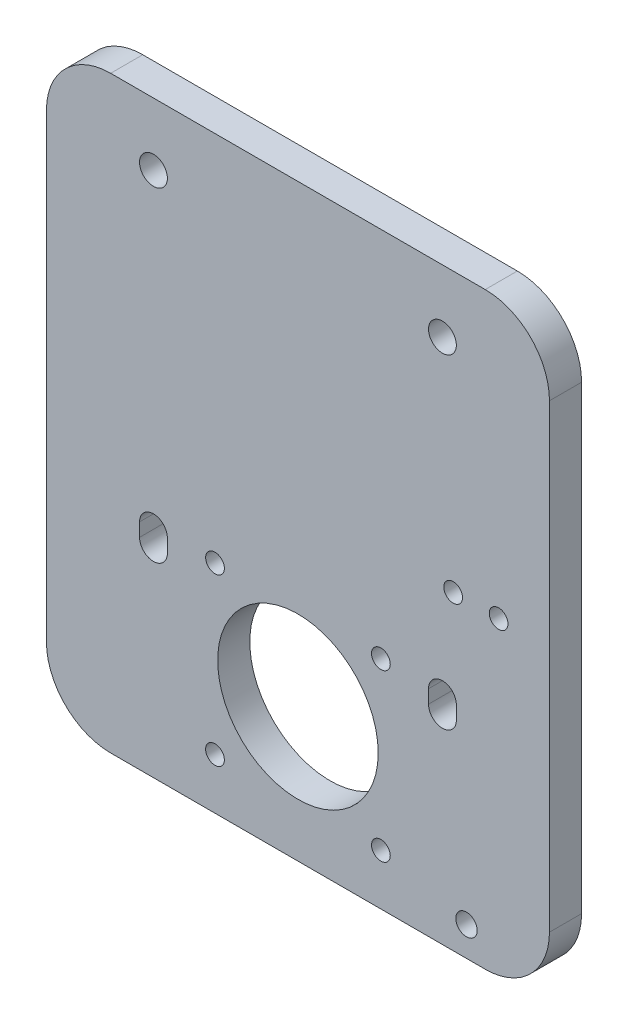
ISO-10303-21;
HEADER;
FILE_DESCRIPTION(('STEP AP214'),'2;1');
FILE_NAME('part.step','',(''),(''),'','','');
FILE_SCHEMA(('AUTOMOTIVE_DESIGN { 1 0 10303 214 1 1 1 1 }'));
ENDSEC;
DATA;
#1=APPLICATION_CONTEXT('core data for automotive mechanical design processes');
#2=APPLICATION_PROTOCOL_DEFINITION('international standard','automotive_design',2000,#1);
#3=PRODUCT_CONTEXT('',#1,'mechanical');
#4=PRODUCT('Part','Part','',(#3));
#5=PRODUCT_RELATED_PRODUCT_CATEGORY('part','',(#4));
#6=PRODUCT_DEFINITION_FORMATION('','',#4);
#7=PRODUCT_DEFINITION_CONTEXT('part definition',#1,'design');
#8=PRODUCT_DEFINITION('design','',#6,#7);
#9=PRODUCT_DEFINITION_SHAPE('','',#8);
#10=(LENGTH_UNIT() NAMED_UNIT(*) SI_UNIT(.MILLI.,.METRE.));
#11=(NAMED_UNIT(*) PLANE_ANGLE_UNIT() SI_UNIT($,.RADIAN.));
#12=(NAMED_UNIT(*) SI_UNIT($,.STERADIAN.) SOLID_ANGLE_UNIT());
#13=UNCERTAINTY_MEASURE_WITH_UNIT(LENGTH_MEASURE(1.E-05),#10,'distance_accuracy_value','');
#14=(GEOMETRIC_REPRESENTATION_CONTEXT(3) GLOBAL_UNCERTAINTY_ASSIGNED_CONTEXT((#13)) GLOBAL_UNIT_ASSIGNED_CONTEXT((#10,
#11,#12)) REPRESENTATION_CONTEXT('',''));
#15=CARTESIAN_POINT('',(0.,0.,0.));
#16=DIRECTION('',(0.,0.,1.));
#17=DIRECTION('',(1.,0.,0.));
#18=AXIS2_PLACEMENT_3D('',#15,#16,#17);
#19=CARTESIAN_POINT('',(27.,37.6,6.));
#20=DIRECTION('',(0.,0.,-1.));
#21=DIRECTION('',(-1.,0.,0.));
#22=AXIS2_PLACEMENT_3D('',#19,#20,#21);
#23=CYLINDRICAL_SURFACE('',#22,2.60000000000222);
#24=CARTESIAN_POINT('',(27.,37.6,0.));
#25=DIRECTION('',(0.,0.,1.));
#26=DIRECTION('',(1.,0.,0.));
#27=AXIS2_PLACEMENT_3D('',#24,#25,#26);
#28=CIRCLE('',#27,2.60000000000222);
#29=CARTESIAN_POINT('',(24.3999999999978,37.6,0.));
#30=VERTEX_POINT('',#29);
#31=CARTESIAN_POINT('',(29.6000000000022,37.6,0.));
#32=VERTEX_POINT('',#31);
#33=EDGE_CURVE('E231',#30,#32,#28,.T.);
#34=ORIENTED_EDGE('',*,*,#33,.F.);
#35=DIRECTION('',(0.,0.,-1.));
#36=VECTOR('',#35,1.);
#37=CARTESIAN_POINT('',(24.3999999999978,37.6,6.));
#38=LINE('',#37,#36);
#39=CARTESIAN_POINT('',(24.3999999999978,37.6,6.));
#40=VERTEX_POINT('',#39);
#41=EDGE_CURVE('E11',#40,#30,#38,.T.);
#42=ORIENTED_EDGE('',*,*,#41,.F.);
#43=CARTESIAN_POINT('',(27.,37.6,6.));
#44=DIRECTION('',(0.,0.,1.));
#45=DIRECTION('',(1.,0.,0.));
#46=AXIS2_PLACEMENT_3D('',#43,#44,#45);
#47=CIRCLE('',#46,2.60000000000222);
#48=CARTESIAN_POINT('',(29.6000000000022,37.6,6.));
#49=VERTEX_POINT('',#48);
#50=EDGE_CURVE('E177',#40,#49,#47,.T.);
#51=ORIENTED_EDGE('',*,*,#50,.T.);
#52=DIRECTION('',(0.,0.,-1.));
#53=VECTOR('',#52,1.);
#54=CARTESIAN_POINT('',(29.6000000000022,37.6,6.));
#55=LINE('',#54,#53);
#56=EDGE_CURVE('E57',#49,#32,#55,.T.);
#57=ORIENTED_EDGE('',*,*,#56,.T.);
#58=EDGE_LOOP('',(#34,#42,#51,#57));
#59=FACE_BOUND('',#58,.T.);
#60=ADVANCED_FACE('F38',(#59),#23,.F.);
#61=CARTESIAN_POINT('',(24.3999999999978,0.,6.));
#62=DIRECTION('',(1.,0.,0.));
#63=DIRECTION('',(0.,0.,-1.));
#64=AXIS2_PLACEMENT_3D('',#61,#62,#63);
#65=PLANE('',#64);
#66=DIRECTION('',(0.,-1.,0.));
#67=VECTOR('',#66,1.);
#68=CARTESIAN_POINT('',(24.3999999999978,0.,0.));
#69=LINE('',#68,#67);
#70=CARTESIAN_POINT('',(24.3999999999978,40.1000000000124,0.));
#71=VERTEX_POINT('',#70);
#72=EDGE_CURVE('E164',#71,#30,#69,.T.);
#73=ORIENTED_EDGE('',*,*,#72,.F.);
#74=DIRECTION('',(0.,0.,-1.));
#75=VECTOR('',#74,1.);
#76=CARTESIAN_POINT('',(24.3999999999978,40.1000000000124,6.));
#77=LINE('',#76,#75);
#78=CARTESIAN_POINT('',(24.3999999999978,40.1000000000124,6.));
#79=VERTEX_POINT('',#78);
#80=EDGE_CURVE('E48',#79,#71,#77,.T.);
#81=ORIENTED_EDGE('',*,*,#80,.F.);
#82=DIRECTION('',(0.,-1.,0.));
#83=VECTOR('',#82,1.);
#84=CARTESIAN_POINT('',(24.3999999999978,0.,6.));
#85=LINE('',#84,#83);
#86=EDGE_CURVE('E162',#79,#40,#85,.T.);
#87=ORIENTED_EDGE('',*,*,#86,.T.);
#88=ORIENTED_EDGE('',*,*,#41,.T.);
#89=EDGE_LOOP('',(#73,#81,#87,#88));
#90=FACE_BOUND('',#89,.T.);
#91=ADVANCED_FACE('F160',(#90),#65,.T.);
#92=CARTESIAN_POINT('',(27.,40.1000000000124,6.));
#93=DIRECTION('',(0.,0.,-1.));
#94=DIRECTION('',(-1.,0.,0.));
#95=AXIS2_PLACEMENT_3D('',#92,#93,#94);
#96=CYLINDRICAL_SURFACE('',#95,2.60000000000222);
#97=CARTESIAN_POINT('',(27.,40.1000000000124,0.));
#98=DIRECTION('',(0.,0.,1.));
#99=DIRECTION('',(1.,0.,0.));
#100=AXIS2_PLACEMENT_3D('',#97,#98,#99);
#101=CIRCLE('',#100,2.60000000000222);
#102=CARTESIAN_POINT('',(29.6000000000022,40.1000000000124,0.));
#103=VERTEX_POINT('',#102);
#104=EDGE_CURVE('E234',#71,#103,#101,.F.);
#105=ORIENTED_EDGE('',*,*,#104,.T.);
#106=DIRECTION('',(0.,0.,-1.));
#107=VECTOR('',#106,1.);
#108=CARTESIAN_POINT('',(29.6000000000022,40.1000000000124,6.));
#109=LINE('',#108,#107);
#110=CARTESIAN_POINT('',(29.6000000000022,40.1000000000124,6.));
#111=VERTEX_POINT('',#110);
#112=EDGE_CURVE('E107',#111,#103,#109,.T.);
#113=ORIENTED_EDGE('',*,*,#112,.F.);
#114=CARTESIAN_POINT('',(27.,40.1000000000124,6.));
#115=DIRECTION('',(0.,0.,1.));
#116=DIRECTION('',(1.,0.,0.));
#117=AXIS2_PLACEMENT_3D('',#114,#115,#116);
#118=CIRCLE('',#117,2.60000000000222);
#119=EDGE_CURVE('E168',#79,#111,#118,.F.);
#120=ORIENTED_EDGE('',*,*,#119,.F.);
#121=ORIENTED_EDGE('',*,*,#80,.T.);
#122=EDGE_LOOP('',(#105,#113,#120,#121));
#123=FACE_BOUND('',#122,.T.);
#124=ADVANCED_FACE('F169',(#123),#96,.F.);
#125=CARTESIAN_POINT('',(-35.,98.,6.));
#126=DIRECTION('',(0.,0.,-1.));
#127=DIRECTION('',(-1.,0.,0.));
#128=AXIS2_PLACEMENT_3D('',#125,#126,#127);
#129=CYLINDRICAL_SURFACE('',#128,12.);
#130=CARTESIAN_POINT('',(-35.,98.,0.));
#131=DIRECTION('',(0.,0.,1.));
#132=DIRECTION('',(1.,0.,0.));
#133=AXIS2_PLACEMENT_3D('',#130,#131,#132);
#134=CIRCLE('',#133,12.);
#135=CARTESIAN_POINT('',(-47.,98.,0.));
#136=VERTEX_POINT('',#135);
#137=CARTESIAN_POINT('',(-35.,110.,0.));
#138=VERTEX_POINT('',#137);
#139=EDGE_CURVE('E204',#136,#138,#134,.F.);
#140=ORIENTED_EDGE('',*,*,#139,.F.);
#141=DIRECTION('',(0.,0.,-1.));
#142=VECTOR('',#141,1.);
#143=CARTESIAN_POINT('',(-47.,98.,6.));
#144=LINE('',#143,#142);
#145=CARTESIAN_POINT('',(-47.,98.,6.));
#146=VERTEX_POINT('',#145);
#147=EDGE_CURVE('E247',#146,#136,#144,.T.);
#148=ORIENTED_EDGE('',*,*,#147,.F.);
#149=CARTESIAN_POINT('',(-35.,98.,6.));
#150=DIRECTION('',(0.,0.,1.));
#151=DIRECTION('',(1.,0.,0.));
#152=AXIS2_PLACEMENT_3D('',#149,#150,#151);
#153=CIRCLE('',#152,12.);
#154=CARTESIAN_POINT('',(-35.,110.,6.));
#155=VERTEX_POINT('',#154);
#156=EDGE_CURVE('E289',#146,#155,#153,.F.);
#157=ORIENTED_EDGE('',*,*,#156,.T.);
#158=DIRECTION('',(0.,0.,-1.));
#159=VECTOR('',#158,1.);
#160=CARTESIAN_POINT('',(-35.,110.,6.));
#161=LINE('',#160,#159);
#162=EDGE_CURVE('E249',#155,#138,#161,.T.);
#163=ORIENTED_EDGE('',*,*,#162,.T.);
#164=EDGE_LOOP('',(#140,#148,#157,#163));
#165=FACE_BOUND('',#164,.T.);
#166=ADVANCED_FACE('F375',(#165),#129,.T.);
#167=CARTESIAN_POINT('',(-47.,0.,6.));
#168=DIRECTION('',(-1.,0.,0.));
#169=DIRECTION('',(0.,-1.,0.));
#170=AXIS2_PLACEMENT_3D('',#167,#168,#169);
#171=PLANE('',#170);
#172=DIRECTION('',(0.,1.,0.));
#173=VECTOR('',#172,1.);
#174=CARTESIAN_POINT('',(-47.,0.,0.));
#175=LINE('',#174,#173);
#176=CARTESIAN_POINT('',(-47.,12.0000000000009,0.));
#177=VERTEX_POINT('',#176);
#178=EDGE_CURVE('E207',#177,#136,#175,.T.);
#179=ORIENTED_EDGE('',*,*,#178,.F.);
#180=DIRECTION('',(0.,0.,-1.));
#181=VECTOR('',#180,1.);
#182=CARTESIAN_POINT('',(-47.,12.0000000000009,6.));
#183=LINE('',#182,#181);
#184=CARTESIAN_POINT('',(-47.,12.0000000000009,6.));
#185=VERTEX_POINT('',#184);
#186=EDGE_CURVE('E261',#185,#177,#183,.T.);
#187=ORIENTED_EDGE('',*,*,#186,.F.);
#188=DIRECTION('',(0.,1.,0.));
#189=VECTOR('',#188,1.);
#190=CARTESIAN_POINT('',(-47.,0.,6.));
#191=LINE('',#190,#189);
#192=EDGE_CURVE('E292',#185,#146,#191,.T.);
#193=ORIENTED_EDGE('',*,*,#192,.T.);
#194=ORIENTED_EDGE('',*,*,#147,.T.);
#195=EDGE_LOOP('',(#179,#187,#193,#194));
#196=FACE_BOUND('',#195,.T.);
#197=ADVANCED_FACE('F371',(#196),#171,.T.);
#198=CARTESIAN_POINT('',(-35.,12.0000000000009,6.));
#199=DIRECTION('',(0.,0.,-1.));
#200=DIRECTION('',(-1.,0.,0.));
#201=AXIS2_PLACEMENT_3D('',#198,#199,#200);
#202=CYLINDRICAL_SURFACE('',#201,12.);
#203=CARTESIAN_POINT('',(-35.,12.0000000000009,0.));
#204=DIRECTION('',(0.,0.,1.));
#205=DIRECTION('',(1.,0.,0.));
#206=AXIS2_PLACEMENT_3D('',#203,#204,#205);
#207=CIRCLE('',#206,12.);
#208=CARTESIAN_POINT('',(-35.,8.88325627822381E-13,0.));
#209=VERTEX_POINT('',#208);
#210=EDGE_CURVE('E210',#177,#209,#207,.T.);
#211=ORIENTED_EDGE('',*,*,#210,.T.);
#212=DIRECTION('',(0.,0.,-1.));
#213=VECTOR('',#212,1.);
#214=CARTESIAN_POINT('',(-35.,8.88325627822381E-13,6.));
#215=LINE('',#214,#213);
#216=CARTESIAN_POINT('',(-35.,8.88325627822381E-13,6.));
#217=VERTEX_POINT('',#216);
#218=EDGE_CURVE('E259',#217,#209,#215,.T.);
#219=ORIENTED_EDGE('',*,*,#218,.F.);
#220=CARTESIAN_POINT('',(-35.,12.0000000000009,6.));
#221=DIRECTION('',(0.,0.,1.));
#222=DIRECTION('',(1.,0.,0.));
#223=AXIS2_PLACEMENT_3D('',#220,#221,#222);
#224=CIRCLE('',#223,12.);
#225=EDGE_CURVE('E299',#185,#217,#224,.T.);
#226=ORIENTED_EDGE('',*,*,#225,.F.);
#227=ORIENTED_EDGE('',*,*,#186,.T.);
#228=EDGE_LOOP('',(#211,#219,#226,#227));
#229=FACE_BOUND('',#228,.T.);
#230=ADVANCED_FACE('F367',(#229),#202,.T.);
#231=CARTESIAN_POINT('',(0.,8.88325627822381E-13,6.));
#232=DIRECTION('',(0.,-1.,0.));
#233=DIRECTION('',(0.,0.,-1.));
#234=AXIS2_PLACEMENT_3D('',#231,#232,#233);
#235=PLANE('',#234);
#236=DIRECTION('',(-1.,0.,0.));
#237=VECTOR('',#236,1.);
#238=CARTESIAN_POINT('',(0.,8.88325627822381E-13,0.));
#239=LINE('',#238,#237);
#240=CARTESIAN_POINT('',(35.,8.88325627822381E-13,0.));
#241=VERTEX_POINT('',#240);
#242=EDGE_CURVE('E213',#241,#209,#239,.T.);
#243=ORIENTED_EDGE('',*,*,#242,.F.);
#244=DIRECTION('',(0.,0.,-1.));
#245=VECTOR('',#244,1.);
#246=CARTESIAN_POINT('',(35.,8.88325627822381E-13,6.));
#247=LINE('',#246,#245);
#248=CARTESIAN_POINT('',(35.,8.88325627822381E-13,6.));
#249=VERTEX_POINT('',#248);
#250=EDGE_CURVE('E257',#249,#241,#247,.T.);
#251=ORIENTED_EDGE('',*,*,#250,.F.);
#252=DIRECTION('',(-1.,0.,0.));
#253=VECTOR('',#252,1.);
#254=CARTESIAN_POINT('',(0.,8.88325627822381E-13,6.));
#255=LINE('',#254,#253);
#256=EDGE_CURVE('E301',#249,#217,#255,.T.);
#257=ORIENTED_EDGE('',*,*,#256,.T.);
#258=ORIENTED_EDGE('',*,*,#218,.T.);
#259=EDGE_LOOP('',(#243,#251,#257,#258));
#260=FACE_BOUND('',#259,.T.);
#261=ADVANCED_FACE('F363',(#260),#235,.T.);
#262=CARTESIAN_POINT('',(35.,12.0000000000009,6.));
#263=DIRECTION('',(0.,0.,-1.));
#264=DIRECTION('',(-1.,0.,0.));
#265=AXIS2_PLACEMENT_3D('',#262,#263,#264);
#266=CYLINDRICAL_SURFACE('',#265,12.);
#267=CARTESIAN_POINT('',(35.,12.0000000000009,0.));
#268=DIRECTION('',(0.,0.,1.));
#269=DIRECTION('',(1.,0.,0.));
#270=AXIS2_PLACEMENT_3D('',#267,#268,#269);
#271=CIRCLE('',#270,12.);
#272=CARTESIAN_POINT('',(47.,12.0000000000009,0.));
#273=VERTEX_POINT('',#272);
#274=EDGE_CURVE('E216',#273,#241,#271,.F.);
#275=ORIENTED_EDGE('',*,*,#274,.F.);
#276=DIRECTION('',(0.,0.,-1.));
#277=VECTOR('',#276,1.);
#278=CARTESIAN_POINT('',(47.,12.0000000000009,6.));
#279=LINE('',#278,#277);
#280=CARTESIAN_POINT('',(47.,12.0000000000009,6.));
#281=VERTEX_POINT('',#280);
#282=EDGE_CURVE('E255',#281,#273,#279,.T.);
#283=ORIENTED_EDGE('',*,*,#282,.F.);
#284=CARTESIAN_POINT('',(35.,12.0000000000009,6.));
#285=DIRECTION('',(0.,0.,1.));
#286=DIRECTION('',(1.,0.,0.));
#287=AXIS2_PLACEMENT_3D('',#284,#285,#286);
#288=CIRCLE('',#287,12.);
#289=EDGE_CURVE('E304',#281,#249,#288,.F.);
#290=ORIENTED_EDGE('',*,*,#289,.T.);
#291=ORIENTED_EDGE('',*,*,#250,.T.);
#292=EDGE_LOOP('',(#275,#283,#290,#291));
#293=FACE_BOUND('',#292,.T.);
#294=ADVANCED_FACE('F359',(#293),#266,.T.);
#295=CARTESIAN_POINT('',(47.,0.,6.));
#296=DIRECTION('',(1.,0.,0.));
#297=DIRECTION('',(0.,0.,-1.));
#298=AXIS2_PLACEMENT_3D('',#295,#296,#297);
#299=PLANE('',#298);
#300=DIRECTION('',(0.,-1.,0.));
#301=VECTOR('',#300,1.);
#302=CARTESIAN_POINT('',(47.,0.,0.));
#303=LINE('',#302,#301);
#304=CARTESIAN_POINT('',(47.,98.,0.));
#305=VERTEX_POINT('',#304);
#306=EDGE_CURVE('E219',#305,#273,#303,.T.);
#307=ORIENTED_EDGE('',*,*,#306,.F.);
#308=DIRECTION('',(0.,0.,-1.));
#309=VECTOR('',#308,1.);
#310=CARTESIAN_POINT('',(47.,98.,6.));
#311=LINE('',#310,#309);
#312=CARTESIAN_POINT('',(47.,98.,6.));
#313=VERTEX_POINT('',#312);
#314=EDGE_CURVE('E253',#313,#305,#311,.T.);
#315=ORIENTED_EDGE('',*,*,#314,.F.);
#316=DIRECTION('',(0.,-1.,0.));
#317=VECTOR('',#316,1.);
#318=CARTESIAN_POINT('',(47.,0.,6.));
#319=LINE('',#318,#317);
#320=EDGE_CURVE('E307',#313,#281,#319,.T.);
#321=ORIENTED_EDGE('',*,*,#320,.T.);
#322=ORIENTED_EDGE('',*,*,#282,.T.);
#323=EDGE_LOOP('',(#307,#315,#321,#322));
#324=FACE_BOUND('',#323,.T.);
#325=ADVANCED_FACE('F355',(#324),#299,.T.);
#326=CARTESIAN_POINT('',(35.,98.,6.));
#327=DIRECTION('',(0.,0.,-1.));
#328=DIRECTION('',(-1.,0.,0.));
#329=AXIS2_PLACEMENT_3D('',#326,#327,#328);
#330=CYLINDRICAL_SURFACE('',#329,12.);
#331=CARTESIAN_POINT('',(35.,98.,0.));
#332=DIRECTION('',(0.,0.,1.));
#333=DIRECTION('',(1.,0.,0.));
#334=AXIS2_PLACEMENT_3D('',#331,#332,#333);
#335=CIRCLE('',#334,12.);
#336=CARTESIAN_POINT('',(35.,110.,0.));
#337=VERTEX_POINT('',#336);
#338=EDGE_CURVE('E222',#337,#305,#335,.F.);
#339=ORIENTED_EDGE('',*,*,#338,.F.);
#340=DIRECTION('',(0.,0.,-1.));
#341=VECTOR('',#340,1.);
#342=CARTESIAN_POINT('',(35.,110.,6.));
#343=LINE('',#342,#341);
#344=CARTESIAN_POINT('',(35.,110.,6.));
#345=VERTEX_POINT('',#344);
#346=EDGE_CURVE('E251',#345,#337,#343,.T.);
#347=ORIENTED_EDGE('',*,*,#346,.F.);
#348=CARTESIAN_POINT('',(35.,98.,6.));
#349=DIRECTION('',(0.,0.,1.));
#350=DIRECTION('',(1.,0.,0.));
#351=AXIS2_PLACEMENT_3D('',#348,#349,#350);
#352=CIRCLE('',#351,12.);
#353=EDGE_CURVE('E310',#345,#313,#352,.F.);
#354=ORIENTED_EDGE('',*,*,#353,.T.);
#355=ORIENTED_EDGE('',*,*,#314,.T.);
#356=EDGE_LOOP('',(#339,#347,#354,#355));
#357=FACE_BOUND('',#356,.T.);
#358=ADVANCED_FACE('F352',(#357),#330,.T.);
#359=CARTESIAN_POINT('',(-27.,40.1000000000124,6.));
#360=DIRECTION('',(0.,0.,-1.));
#361=DIRECTION('',(-1.,0.,0.));
#362=AXIS2_PLACEMENT_3D('',#359,#360,#361);
#363=CYLINDRICAL_SURFACE('',#362,2.60000000000222);
#364=CARTESIAN_POINT('',(-27.,40.1000000000124,0.));
#365=DIRECTION('',(0.,0.,1.));
#366=DIRECTION('',(1.,0.,0.));
#367=AXIS2_PLACEMENT_3D('',#364,#365,#366);
#368=CIRCLE('',#367,2.60000000000222);
#369=CARTESIAN_POINT('',(-24.3999999999978,40.1000000000124,0.));
#370=VERTEX_POINT('',#369);
#371=CARTESIAN_POINT('',(-29.6000000000022,40.1000000000124,0.));
#372=VERTEX_POINT('',#371);
#373=EDGE_CURVE('E191',#370,#372,#368,.T.);
#374=ORIENTED_EDGE('',*,*,#373,.F.);
#375=DIRECTION('',(0.,0.,-1.));
#376=VECTOR('',#375,1.);
#377=CARTESIAN_POINT('',(-24.3999999999978,40.1000000000124,6.));
#378=LINE('',#377,#376);
#379=CARTESIAN_POINT('',(-24.3999999999978,40.1000000000124,6.));
#380=VERTEX_POINT('',#379);
#381=EDGE_CURVE('E42',#380,#370,#378,.T.);
#382=ORIENTED_EDGE('',*,*,#381,.F.);
#383=CARTESIAN_POINT('',(-27.,40.1000000000124,6.));
#384=DIRECTION('',(0.,0.,1.));
#385=DIRECTION('',(1.,0.,0.));
#386=AXIS2_PLACEMENT_3D('',#383,#384,#385);
#387=CIRCLE('',#386,2.60000000000222);
#388=CARTESIAN_POINT('',(-29.6000000000022,40.1000000000124,6.));
#389=VERTEX_POINT('',#388);
#390=EDGE_CURVE('E245',#380,#389,#387,.T.);
#391=ORIENTED_EDGE('',*,*,#390,.T.);
#392=DIRECTION('',(0.,0.,-1.));
#393=VECTOR('',#392,1.);
#394=CARTESIAN_POINT('',(-29.6000000000022,40.1000000000124,6.));
#395=LINE('',#394,#393);
#396=EDGE_CURVE('E190',#389,#372,#395,.T.);
#397=ORIENTED_EDGE('',*,*,#396,.T.);
#398=EDGE_LOOP('',(#374,#382,#391,#397));
#399=FACE_BOUND('',#398,.T.);
#400=ADVANCED_FACE('F40',(#399),#363,.F.);
#401=CARTESIAN_POINT('',(-24.3999999999978,0.,6.));
#402=DIRECTION('',(-1.,0.,0.));
#403=DIRECTION('',(0.,0.,1.));
#404=AXIS2_PLACEMENT_3D('',#401,#402,#403);
#405=PLANE('',#404);
#406=DIRECTION('',(0.,1.,0.));
#407=VECTOR('',#406,1.);
#408=CARTESIAN_POINT('',(-24.3999999999978,0.,0.));
#409=LINE('',#408,#407);
#410=CARTESIAN_POINT('',(-24.3999999999978,37.6,0.));
#411=VERTEX_POINT('',#410);
#412=EDGE_CURVE('E194',#411,#370,#409,.T.);
#413=ORIENTED_EDGE('',*,*,#412,.F.);
#414=DIRECTION('',(0.,0.,-1.));
#415=VECTOR('',#414,1.);
#416=CARTESIAN_POINT('',(-24.3999999999978,37.6,6.));
#417=LINE('',#416,#415);
#418=CARTESIAN_POINT('',(-24.3999999999978,37.6,6.));
#419=VERTEX_POINT('',#418);
#420=EDGE_CURVE('E266',#419,#411,#417,.T.);
#421=ORIENTED_EDGE('',*,*,#420,.F.);
#422=DIRECTION('',(0.,1.,0.));
#423=VECTOR('',#422,1.);
#424=CARTESIAN_POINT('',(-24.3999999999978,0.,6.));
#425=LINE('',#424,#423);
#426=EDGE_CURVE('E275',#419,#380,#425,.T.);
#427=ORIENTED_EDGE('',*,*,#426,.T.);
#428=ORIENTED_EDGE('',*,*,#381,.T.);
#429=EDGE_LOOP('',(#413,#421,#427,#428));
#430=FACE_BOUND('',#429,.T.);
#431=ADVANCED_FACE('F273',(#430),#405,.T.);
#432=CARTESIAN_POINT('',(-27.,37.6,6.));
#433=DIRECTION('',(0.,0.,-1.));
#434=DIRECTION('',(-1.,0.,0.));
#435=AXIS2_PLACEMENT_3D('',#432,#433,#434);
#436=CYLINDRICAL_SURFACE('',#435,2.60000000000222);
#437=CARTESIAN_POINT('',(-27.,37.6,0.));
#438=DIRECTION('',(0.,0.,1.));
#439=DIRECTION('',(1.,0.,0.));
#440=AXIS2_PLACEMENT_3D('',#437,#438,#439);
#441=CIRCLE('',#440,2.60000000000222);
#442=CARTESIAN_POINT('',(-29.6000000000022,37.6,0.));
#443=VERTEX_POINT('',#442);
#444=EDGE_CURVE('E198',#411,#443,#441,.F.);
#445=ORIENTED_EDGE('',*,*,#444,.T.);
#446=DIRECTION('',(0.,0.,-1.));
#447=VECTOR('',#446,1.);
#448=CARTESIAN_POINT('',(-29.6000000000022,37.6,6.));
#449=LINE('',#448,#447);
#450=CARTESIAN_POINT('',(-29.6000000000022,37.6,6.));
#451=VERTEX_POINT('',#450);
#452=EDGE_CURVE('E265',#451,#443,#449,.T.);
#453=ORIENTED_EDGE('',*,*,#452,.F.);
#454=CARTESIAN_POINT('',(-27.,37.6,6.));
#455=DIRECTION('',(0.,0.,1.));
#456=DIRECTION('',(1.,0.,0.));
#457=AXIS2_PLACEMENT_3D('',#454,#455,#456);
#458=CIRCLE('',#457,2.60000000000222);
#459=EDGE_CURVE('E283',#419,#451,#458,.F.);
#460=ORIENTED_EDGE('',*,*,#459,.F.);
#461=ORIENTED_EDGE('',*,*,#420,.T.);
#462=EDGE_LOOP('',(#445,#453,#460,#461));
#463=FACE_BOUND('',#462,.T.);
#464=ADVANCED_FACE('F281',(#463),#436,.F.);
#465=CARTESIAN_POINT('',(27.,98.3000000000124,6.));
#466=DIRECTION('',(0.,0.,-1.));
#467=DIRECTION('',(-1.,0.,0.));
#468=AXIS2_PLACEMENT_3D('',#465,#466,#467);
#469=CYLINDRICAL_SURFACE('',#468,2.6);
#470=CARTESIAN_POINT('',(27.,98.3000000000124,6.));
#471=DIRECTION('',(0.,0.,1.));
#472=DIRECTION('',(1.,0.,0.));
#473=AXIS2_PLACEMENT_3D('',#470,#471,#472);
#474=CIRCLE('',#473,2.6);
#475=CARTESIAN_POINT('',(29.6,98.3000000000124,6.));
#476=VERTEX_POINT('',#475);
#477=EDGE_CURVE('E184',#476,#476,#474,.T.);
#478=ORIENTED_EDGE('',*,*,#477,.T.);
#479=EDGE_LOOP('',(#478));
#480=FACE_BOUND('',#479,.T.);
#481=CARTESIAN_POINT('',(27.,98.3000000000124,0.));
#482=DIRECTION('',(0.,0.,1.));
#483=DIRECTION('',(1.,0.,0.));
#484=AXIS2_PLACEMENT_3D('',#481,#482,#483);
#485=CIRCLE('',#484,2.6);
#486=CARTESIAN_POINT('',(29.6,98.3000000000124,0.));
#487=VERTEX_POINT('',#486);
#488=EDGE_CURVE('E239',#487,#487,#485,.T.);
#489=ORIENTED_EDGE('',*,*,#488,.F.);
#490=EDGE_LOOP('',(#489));
#491=FACE_BOUND('',#490,.T.);
#492=ADVANCED_FACE('F383',(#480,#491),#469,.F.);
#493=CARTESIAN_POINT('',(29.6000000000022,0.,6.));
#494=DIRECTION('',(-1.,0.,0.));
#495=DIRECTION('',(0.,0.,1.));
#496=AXIS2_PLACEMENT_3D('',#493,#494,#495);
#497=PLANE('',#496);
#498=DIRECTION('',(0.,1.,0.));
#499=VECTOR('',#498,1.);
#500=CARTESIAN_POINT('',(29.6000000000022,0.,0.));
#501=LINE('',#500,#499);
#502=EDGE_CURVE('E236',#32,#103,#501,.T.);
#503=ORIENTED_EDGE('',*,*,#502,.F.);
#504=ORIENTED_EDGE('',*,*,#56,.F.);
#505=DIRECTION('',(0.,1.,0.));
#506=VECTOR('',#505,1.);
#507=CARTESIAN_POINT('',(29.6000000000022,0.,6.));
#508=LINE('',#507,#506);
#509=EDGE_CURVE('E172',#49,#111,#508,.T.);
#510=ORIENTED_EDGE('',*,*,#509,.T.);
#511=ORIENTED_EDGE('',*,*,#112,.T.);
#512=EDGE_LOOP('',(#503,#504,#510,#511));
#513=FACE_BOUND('',#512,.T.);
#514=ADVANCED_FACE('F348',(#513),#497,.T.);
#515=CARTESIAN_POINT('',(0.,25.,6.));
#516=DIRECTION('',(0.,0.,-1.));
#517=DIRECTION('',(-1.,0.,0.));
#518=AXIS2_PLACEMENT_3D('',#515,#516,#517);
#519=CYLINDRICAL_SURFACE('',#518,15.);
#520=CARTESIAN_POINT('',(0.,25.,6.));
#521=DIRECTION('',(0.,0.,1.));
#522=DIRECTION('',(1.,0.,0.));
#523=AXIS2_PLACEMENT_3D('',#520,#521,#522);
#524=CIRCLE('',#523,15.);
#525=CARTESIAN_POINT('',(15.,25.,6.));
#526=VERTEX_POINT('',#525);
#527=EDGE_CURVE('E179',#526,#526,#524,.T.);
#528=ORIENTED_EDGE('',*,*,#527,.T.);
#529=EDGE_LOOP('',(#528));
#530=FACE_BOUND('',#529,.T.);
#531=CARTESIAN_POINT('',(0.,25.,0.));
#532=DIRECTION('',(0.,0.,1.));
#533=DIRECTION('',(1.,0.,0.));
#534=AXIS2_PLACEMENT_3D('',#531,#532,#533);
#535=CIRCLE('',#534,15.);
#536=CARTESIAN_POINT('',(15.,25.,0.));
#537=VERTEX_POINT('',#536);
#538=EDGE_CURVE('E228',#537,#537,#535,.T.);
#539=ORIENTED_EDGE('',*,*,#538,.F.);
#540=EDGE_LOOP('',(#539));
#541=FACE_BOUND('',#540,.T.);
#542=ADVANCED_FACE('F318',(#530,#541),#519,.F.);
#543=CARTESIAN_POINT('',(0.,110.,6.));
#544=DIRECTION('',(0.,1.,0.));
#545=DIRECTION('',(0.,0.,1.));
#546=AXIS2_PLACEMENT_3D('',#543,#544,#545);
#547=PLANE('',#546);
#548=DIRECTION('',(1.,0.,0.));
#549=VECTOR('',#548,1.);
#550=CARTESIAN_POINT('',(0.,110.,0.));
#551=LINE('',#550,#549);
#552=EDGE_CURVE('E225',#138,#337,#551,.T.);
#553=ORIENTED_EDGE('',*,*,#552,.F.);
#554=ORIENTED_EDGE('',*,*,#162,.F.);
#555=DIRECTION('',(1.,0.,0.));
#556=VECTOR('',#555,1.);
#557=CARTESIAN_POINT('',(0.,110.,6.));
#558=LINE('',#557,#556);
#559=EDGE_CURVE('E313',#155,#345,#558,.T.);
#560=ORIENTED_EDGE('',*,*,#559,.T.);
#561=ORIENTED_EDGE('',*,*,#346,.T.);
#562=EDGE_LOOP('',(#553,#554,#560,#561));
#563=FACE_BOUND('',#562,.T.);
#564=ADVANCED_FACE('F347',(#563),#547,.T.);
#565=CARTESIAN_POINT('',(-29.6000000000022,0.,6.));
#566=DIRECTION('',(1.,0.,0.));
#567=DIRECTION('',(0.,0.,-1.));
#568=AXIS2_PLACEMENT_3D('',#565,#566,#567);
#569=PLANE('',#568);
#570=DIRECTION('',(0.,-1.,0.));
#571=VECTOR('',#570,1.);
#572=CARTESIAN_POINT('',(-29.6000000000022,0.,0.));
#573=LINE('',#572,#571);
#574=EDGE_CURVE('E201',#372,#443,#573,.T.);
#575=ORIENTED_EDGE('',*,*,#574,.F.);
#576=ORIENTED_EDGE('',*,*,#396,.F.);
#577=DIRECTION('',(0.,-1.,0.));
#578=VECTOR('',#577,1.);
#579=CARTESIAN_POINT('',(-29.6000000000022,0.,6.));
#580=LINE('',#579,#578);
#581=EDGE_CURVE('E286',#389,#451,#580,.T.);
#582=ORIENTED_EDGE('',*,*,#581,.T.);
#583=ORIENTED_EDGE('',*,*,#452,.T.);
#584=EDGE_LOOP('',(#575,#576,#582,#583));
#585=FACE_BOUND('',#584,.T.);
#586=ADVANCED_FACE('F287',(#585),#569,.T.);
#587=CARTESIAN_POINT('',(-27.,98.3000000000124,6.));
#588=DIRECTION('',(0.,0.,-1.));
#589=DIRECTION('',(-1.,0.,0.));
#590=AXIS2_PLACEMENT_3D('',#587,#588,#589);
#591=CYLINDRICAL_SURFACE('',#590,2.6);
#592=CARTESIAN_POINT('',(-27.,98.3000000000124,6.));
#593=DIRECTION('',(0.,0.,1.));
#594=DIRECTION('',(1.,0.,0.));
#595=AXIS2_PLACEMENT_3D('',#592,#593,#594);
#596=CIRCLE('',#595,2.6);
#597=CARTESIAN_POINT('',(-24.4,98.3000000000124,6.));
#598=VERTEX_POINT('',#597);
#599=EDGE_CURVE('E187',#598,#598,#596,.F.);
#600=ORIENTED_EDGE('',*,*,#599,.F.);
#601=EDGE_LOOP('',(#600));
#602=FACE_BOUND('',#601,.T.);
#603=CARTESIAN_POINT('',(-27.,98.3000000000124,0.));
#604=DIRECTION('',(0.,0.,1.));
#605=DIRECTION('',(1.,0.,0.));
#606=AXIS2_PLACEMENT_3D('',#603,#604,#605);
#607=CIRCLE('',#606,2.6);
#608=CARTESIAN_POINT('',(-24.4,98.3000000000124,0.));
#609=VERTEX_POINT('',#608);
#610=EDGE_CURVE('E242',#609,#609,#607,.F.);
#611=ORIENTED_EDGE('',*,*,#610,.T.);
#612=EDGE_LOOP('',(#611));
#613=FACE_BOUND('',#612,.T.);
#614=ADVANCED_FACE('F322',(#602,#613),#591,.F.);
#615=CARTESIAN_POINT('',(0.,0.,6.));
#616=DIRECTION('',(0.,0.,1.));
#617=DIRECTION('',(1.,0.,0.));
#618=AXIS2_PLACEMENT_3D('',#615,#616,#617);
#619=PLANE('',#618);
#620=CARTESIAN_POINT('',(37.5,58.,6.00000000000001));
#621=DIRECTION('',(0.,0.,-1.));
#622=DIRECTION('',(-1.,0.,0.));
#623=AXIS2_PLACEMENT_3D('',#620,#621,#622);
#624=CIRCLE('',#623,1.74999999999999);
#625=CARTESIAN_POINT('',(35.75,58.,6.00000000000001));
#626=VERTEX_POINT('',#625);
#627=EDGE_CURVE('E691',#626,#626,#624,.T.);
#628=ORIENTED_EDGE('',*,*,#627,.T.);
#629=EDGE_LOOP('',(#628));
#630=FACE_BOUND('',#629,.T.);
#631=CARTESIAN_POINT('',(29.,58.0000000000009,6.00000000000001));
#632=DIRECTION('',(0.,0.,-1.));
#633=DIRECTION('',(-1.,0.,0.));
#634=AXIS2_PLACEMENT_3D('',#631,#632,#633);
#635=CIRCLE('',#634,1.74999999999999);
#636=CARTESIAN_POINT('',(27.25,58.0000000000009,6.00000000000001));
#637=VERTEX_POINT('',#636);
#638=EDGE_CURVE('E685',#637,#637,#635,.T.);
#639=ORIENTED_EDGE('',*,*,#638,.T.);
#640=EDGE_LOOP('',(#639));
#641=FACE_BOUND('',#640,.T.);
#642=CARTESIAN_POINT('',(-15.5,40.5,6.));
#643=DIRECTION('',(0.,0.,1.));
#644=DIRECTION('',(1.,0.,0.));
#645=AXIS2_PLACEMENT_3D('',#642,#643,#644);
#646=CIRCLE('',#645,1.75);
#647=CARTESIAN_POINT('',(-13.75,40.5,6.));
#648=VERTEX_POINT('',#647);
#649=EDGE_CURVE('E682',#648,#648,#646,.T.);
#650=ORIENTED_EDGE('',*,*,#649,.F.);
#651=EDGE_LOOP('',(#650));
#652=FACE_BOUND('',#651,.T.);
#653=CARTESIAN_POINT('',(-15.5,9.49999999999999,6.));
#654=DIRECTION('',(0.,0.,1.));
#655=DIRECTION('',(1.,0.,0.));
#656=AXIS2_PLACEMENT_3D('',#653,#654,#655);
#657=CIRCLE('',#656,1.75);
#658=CARTESIAN_POINT('',(-13.75,9.49999999999999,6.));
#659=VERTEX_POINT('',#658);
#660=EDGE_CURVE('E676',#659,#659,#657,.T.);
#661=ORIENTED_EDGE('',*,*,#660,.F.);
#662=EDGE_LOOP('',(#661));
#663=FACE_BOUND('',#662,.T.);
#664=CARTESIAN_POINT('',(15.5,9.49999999999999,6.));
#665=DIRECTION('',(0.,0.,1.));
#666=DIRECTION('',(1.,0.,0.));
#667=AXIS2_PLACEMENT_3D('',#664,#665,#666);
#668=CIRCLE('',#667,1.75);
#669=CARTESIAN_POINT('',(17.25,9.49999999999999,6.));
#670=VERTEX_POINT('',#669);
#671=EDGE_CURVE('E529',#670,#670,#668,.T.);
#672=ORIENTED_EDGE('',*,*,#671,.F.);
#673=EDGE_LOOP('',(#672));
#674=FACE_BOUND('',#673,.T.);
#675=CARTESIAN_POINT('',(15.5,40.5,6.));
#676=DIRECTION('',(0.,0.,1.));
#677=DIRECTION('',(1.,0.,0.));
#678=AXIS2_PLACEMENT_3D('',#675,#676,#677);
#679=CIRCLE('',#678,1.75);
#680=CARTESIAN_POINT('',(17.25,40.5,6.));
#681=VERTEX_POINT('',#680);
#682=EDGE_CURVE('E522',#681,#681,#679,.T.);
#683=ORIENTED_EDGE('',*,*,#682,.F.);
#684=EDGE_LOOP('',(#683));
#685=FACE_BOUND('',#684,.T.);
#686=CARTESIAN_POINT('',(31.5,5.50000000000089,6.));
#687=DIRECTION('',(0.,0.,1.));
#688=DIRECTION('',(1.,0.,0.));
#689=AXIS2_PLACEMENT_3D('',#686,#687,#688);
#690=CIRCLE('',#689,2.);
#691=CARTESIAN_POINT('',(33.5,5.50000000000089,6.));
#692=VERTEX_POINT('',#691);
#693=EDGE_CURVE('E526',#692,#692,#690,.T.);
#694=ORIENTED_EDGE('',*,*,#693,.F.);
#695=EDGE_LOOP('',(#694));
#696=FACE_BOUND('',#695,.T.);
#697=ORIENTED_EDGE('',*,*,#390,.F.);
#698=ORIENTED_EDGE('',*,*,#426,.F.);
#699=ORIENTED_EDGE('',*,*,#459,.T.);
#700=ORIENTED_EDGE('',*,*,#581,.F.);
#701=EDGE_LOOP('',(#697,#698,#699,#700));
#702=FACE_BOUND('',#701,.T.);
#703=ORIENTED_EDGE('',*,*,#156,.F.);
#704=ORIENTED_EDGE('',*,*,#192,.F.);
#705=ORIENTED_EDGE('',*,*,#225,.T.);
#706=ORIENTED_EDGE('',*,*,#256,.F.);
#707=ORIENTED_EDGE('',*,*,#289,.F.);
#708=ORIENTED_EDGE('',*,*,#320,.F.);
#709=ORIENTED_EDGE('',*,*,#353,.F.);
#710=ORIENTED_EDGE('',*,*,#559,.F.);
#711=EDGE_LOOP('',(#703,#704,#705,#706,#707,#708,#709,#710));
#712=FACE_BOUND('',#711,.T.);
#713=ORIENTED_EDGE('',*,*,#527,.F.);
#714=EDGE_LOOP('',(#713));
#715=FACE_BOUND('',#714,.T.);
#716=ORIENTED_EDGE('',*,*,#50,.F.);
#717=ORIENTED_EDGE('',*,*,#86,.F.);
#718=ORIENTED_EDGE('',*,*,#119,.T.);
#719=ORIENTED_EDGE('',*,*,#509,.F.);
#720=EDGE_LOOP('',(#716,#717,#718,#719));
#721=FACE_BOUND('',#720,.T.);
#722=ORIENTED_EDGE('',*,*,#477,.F.);
#723=EDGE_LOOP('',(#722));
#724=FACE_BOUND('',#723,.T.);
#725=ORIENTED_EDGE('',*,*,#599,.T.);
#726=EDGE_LOOP('',(#725));
#727=FACE_BOUND('',#726,.T.);
#728=ADVANCED_FACE('F175',(#630,#641,#652,#663,#674,#685,#696,#702,#712,#715,#721,#724,#727),
#619,.T.);
#729=CARTESIAN_POINT('',(0.,0.,0.));
#730=DIRECTION('',(0.,0.,1.));
#731=DIRECTION('',(1.,0.,0.));
#732=AXIS2_PLACEMENT_3D('',#729,#730,#731);
#733=PLANE('',#732);
#734=CARTESIAN_POINT('',(37.5,58.,0.));
#735=DIRECTION('',(0.,0.,-1.));
#736=DIRECTION('',(-1.,0.,0.));
#737=AXIS2_PLACEMENT_3D('',#734,#735,#736);
#738=CIRCLE('',#737,1.74999999999999);
#739=CARTESIAN_POINT('',(35.75,58.,0.));
#740=VERTEX_POINT('',#739);
#741=EDGE_CURVE('E693',#740,#740,#738,.T.);
#742=ORIENTED_EDGE('',*,*,#741,.F.);
#743=EDGE_LOOP('',(#742));
#744=FACE_BOUND('',#743,.T.);
#745=CARTESIAN_POINT('',(29.,58.0000000000009,0.));
#746=DIRECTION('',(0.,0.,-1.));
#747=DIRECTION('',(-1.,0.,0.));
#748=AXIS2_PLACEMENT_3D('',#745,#746,#747);
#749=CIRCLE('',#748,1.74999999999999);
#750=CARTESIAN_POINT('',(27.25,58.0000000000009,0.));
#751=VERTEX_POINT('',#750);
#752=EDGE_CURVE('E688',#751,#751,#749,.T.);
#753=ORIENTED_EDGE('',*,*,#752,.F.);
#754=EDGE_LOOP('',(#753));
#755=FACE_BOUND('',#754,.T.);
#756=CARTESIAN_POINT('',(-15.5,40.5,0.));
#757=DIRECTION('',(0.,0.,1.));
#758=DIRECTION('',(1.,0.,0.));
#759=AXIS2_PLACEMENT_3D('',#756,#757,#758);
#760=CIRCLE('',#759,1.75);
#761=CARTESIAN_POINT('',(-13.75,40.5,0.));
#762=VERTEX_POINT('',#761);
#763=EDGE_CURVE('E679',#762,#762,#760,.T.);
#764=ORIENTED_EDGE('',*,*,#763,.T.);
#765=EDGE_LOOP('',(#764));
#766=FACE_BOUND('',#765,.T.);
#767=CARTESIAN_POINT('',(-15.5,9.49999999999999,0.));
#768=DIRECTION('',(0.,0.,1.));
#769=DIRECTION('',(1.,0.,0.));
#770=AXIS2_PLACEMENT_3D('',#767,#768,#769);
#771=CIRCLE('',#770,1.75);
#772=CARTESIAN_POINT('',(-13.75,9.49999999999999,0.));
#773=VERTEX_POINT('',#772);
#774=EDGE_CURVE('E673',#773,#773,#771,.T.);
#775=ORIENTED_EDGE('',*,*,#774,.T.);
#776=EDGE_LOOP('',(#775));
#777=FACE_BOUND('',#776,.T.);
#778=CARTESIAN_POINT('',(15.5,9.49999999999999,0.));
#779=DIRECTION('',(0.,0.,1.));
#780=DIRECTION('',(1.,0.,0.));
#781=AXIS2_PLACEMENT_3D('',#778,#779,#780);
#782=CIRCLE('',#781,1.75);
#783=CARTESIAN_POINT('',(17.25,9.49999999999999,0.));
#784=VERTEX_POINT('',#783);
#785=EDGE_CURVE('E524',#784,#784,#782,.T.);
#786=ORIENTED_EDGE('',*,*,#785,.T.);
#787=EDGE_LOOP('',(#786));
#788=FACE_BOUND('',#787,.T.);
#789=CARTESIAN_POINT('',(15.5,40.5,0.));
#790=DIRECTION('',(0.,0.,1.));
#791=DIRECTION('',(1.,0.,0.));
#792=AXIS2_PLACEMENT_3D('',#789,#790,#791);
#793=CIRCLE('',#792,1.75);
#794=CARTESIAN_POINT('',(17.25,40.5,0.));
#795=VERTEX_POINT('',#794);
#796=EDGE_CURVE('E519',#795,#795,#793,.T.);
#797=ORIENTED_EDGE('',*,*,#796,.T.);
#798=EDGE_LOOP('',(#797));
#799=FACE_BOUND('',#798,.T.);
#800=CARTESIAN_POINT('',(31.5,5.50000000000089,0.));
#801=DIRECTION('',(0.,0.,1.));
#802=DIRECTION('',(1.,0.,0.));
#803=AXIS2_PLACEMENT_3D('',#800,#801,#802);
#804=CIRCLE('',#803,2.);
#805=CARTESIAN_POINT('',(33.5,5.50000000000089,0.));
#806=VERTEX_POINT('',#805);
#807=EDGE_CURVE('E195',#806,#806,#804,.T.);
#808=ORIENTED_EDGE('',*,*,#807,.T.);
#809=EDGE_LOOP('',(#808));
#810=FACE_BOUND('',#809,.T.);
#811=ORIENTED_EDGE('',*,*,#373,.T.);
#812=ORIENTED_EDGE('',*,*,#574,.T.);
#813=ORIENTED_EDGE('',*,*,#444,.F.);
#814=ORIENTED_EDGE('',*,*,#412,.T.);
#815=EDGE_LOOP('',(#811,#812,#813,#814));
#816=FACE_BOUND('',#815,.T.);
#817=ORIENTED_EDGE('',*,*,#139,.T.);
#818=ORIENTED_EDGE('',*,*,#552,.T.);
#819=ORIENTED_EDGE('',*,*,#338,.T.);
#820=ORIENTED_EDGE('',*,*,#306,.T.);
#821=ORIENTED_EDGE('',*,*,#274,.T.);
#822=ORIENTED_EDGE('',*,*,#242,.T.);
#823=ORIENTED_EDGE('',*,*,#210,.F.);
#824=ORIENTED_EDGE('',*,*,#178,.T.);
#825=EDGE_LOOP('',(#817,#818,#819,#820,#821,#822,#823,#824));
#826=FACE_BOUND('',#825,.T.);
#827=ORIENTED_EDGE('',*,*,#538,.T.);
#828=EDGE_LOOP('',(#827));
#829=FACE_BOUND('',#828,.T.);
#830=ORIENTED_EDGE('',*,*,#33,.T.);
#831=ORIENTED_EDGE('',*,*,#502,.T.);
#832=ORIENTED_EDGE('',*,*,#104,.F.);
#833=ORIENTED_EDGE('',*,*,#72,.T.);
#834=EDGE_LOOP('',(#830,#831,#832,#833));
#835=FACE_BOUND('',#834,.T.);
#836=ORIENTED_EDGE('',*,*,#488,.T.);
#837=EDGE_LOOP('',(#836));
#838=FACE_BOUND('',#837,.T.);
#839=ORIENTED_EDGE('',*,*,#610,.F.);
#840=EDGE_LOOP('',(#839));
#841=FACE_BOUND('',#840,.T.);
#842=ADVANCED_FACE('F278',(#744,#755,#766,#777,#788,#799,#810,#816,#826,#829,#835,#838,#841),
#733,.F.);
#843=CARTESIAN_POINT('',(31.5,5.50000000000089,0.));
#844=DIRECTION('',(0.,0.,1.));
#845=DIRECTION('',(1.,0.,0.));
#846=AXIS2_PLACEMENT_3D('',#843,#844,#845);
#847=CYLINDRICAL_SURFACE('',#846,2.);
#848=ORIENTED_EDGE('',*,*,#807,.F.);
#849=EDGE_LOOP('',(#848));
#850=FACE_BOUND('',#849,.T.);
#851=ORIENTED_EDGE('',*,*,#693,.T.);
#852=EDGE_LOOP('',(#851));
#853=FACE_BOUND('',#852,.T.);
#854=ADVANCED_FACE('F329',(#850,#853),#847,.F.);
#855=CARTESIAN_POINT('',(15.5,40.5,6.));
#856=DIRECTION('',(0.,0.,1.));
#857=DIRECTION('',(1.,0.,0.));
#858=AXIS2_PLACEMENT_3D('',#855,#856,#857);
#859=CYLINDRICAL_SURFACE('',#858,1.75);
#860=ORIENTED_EDGE('',*,*,#796,.F.);
#861=EDGE_LOOP('',(#860));
#862=FACE_BOUND('',#861,.T.);
#863=ORIENTED_EDGE('',*,*,#682,.T.);
#864=EDGE_LOOP('',(#863));
#865=FACE_BOUND('',#864,.T.);
#866=ADVANCED_FACE('F458',(#862,#865),#859,.F.);
#867=CARTESIAN_POINT('',(15.5,9.49999999999999,6.));
#868=DIRECTION('',(0.,0.,1.));
#869=DIRECTION('',(1.,0.,0.));
#870=AXIS2_PLACEMENT_3D('',#867,#868,#869);
#871=CYLINDRICAL_SURFACE('',#870,1.75);
#872=ORIENTED_EDGE('',*,*,#785,.F.);
#873=EDGE_LOOP('',(#872));
#874=FACE_BOUND('',#873,.T.);
#875=ORIENTED_EDGE('',*,*,#671,.T.);
#876=EDGE_LOOP('',(#875));
#877=FACE_BOUND('',#876,.T.);
#878=ADVANCED_FACE('F509',(#874,#877),#871,.F.);
#879=CARTESIAN_POINT('',(-15.5,9.49999999999999,6.));
#880=DIRECTION('',(0.,0.,1.));
#881=DIRECTION('',(1.,0.,0.));
#882=AXIS2_PLACEMENT_3D('',#879,#880,#881);
#883=CYLINDRICAL_SURFACE('',#882,1.75);
#884=ORIENTED_EDGE('',*,*,#774,.F.);
#885=EDGE_LOOP('',(#884));
#886=FACE_BOUND('',#885,.T.);
#887=ORIENTED_EDGE('',*,*,#660,.T.);
#888=EDGE_LOOP('',(#887));
#889=FACE_BOUND('',#888,.T.);
#890=ADVANCED_FACE('F505',(#886,#889),#883,.F.);
#891=CARTESIAN_POINT('',(-15.5,40.5,6.));
#892=DIRECTION('',(0.,0.,1.));
#893=DIRECTION('',(1.,0.,0.));
#894=AXIS2_PLACEMENT_3D('',#891,#892,#893);
#895=CYLINDRICAL_SURFACE('',#894,1.75);
#896=ORIENTED_EDGE('',*,*,#763,.F.);
#897=EDGE_LOOP('',(#896));
#898=FACE_BOUND('',#897,.T.);
#899=ORIENTED_EDGE('',*,*,#649,.T.);
#900=EDGE_LOOP('',(#899));
#901=FACE_BOUND('',#900,.T.);
#902=ADVANCED_FACE('F485',(#898,#901),#895,.F.);
#903=CARTESIAN_POINT('',(29.,58.0000000000009,0.));
#904=DIRECTION('',(0.,0.,-1.));
#905=DIRECTION('',(-1.,0.,0.));
#906=AXIS2_PLACEMENT_3D('',#903,#904,#905);
#907=CYLINDRICAL_SURFACE('',#906,1.74999999999999);
#908=ORIENTED_EDGE('',*,*,#638,.F.);
#909=EDGE_LOOP('',(#908));
#910=FACE_BOUND('',#909,.T.);
#911=ORIENTED_EDGE('',*,*,#752,.T.);
#912=EDGE_LOOP('',(#911));
#913=FACE_BOUND('',#912,.T.);
#914=ADVANCED_FACE('F479',(#910,#913),#907,.F.);
#915=CARTESIAN_POINT('',(37.5,58.,0.));
#916=DIRECTION('',(0.,0.,-1.));
#917=DIRECTION('',(-1.,0.,0.));
#918=AXIS2_PLACEMENT_3D('',#915,#916,#917);
#919=CYLINDRICAL_SURFACE('',#918,1.74999999999999);
#920=ORIENTED_EDGE('',*,*,#627,.F.);
#921=EDGE_LOOP('',(#920));
#922=FACE_BOUND('',#921,.T.);
#923=ORIENTED_EDGE('',*,*,#741,.T.);
#924=EDGE_LOOP('',(#923));
#925=FACE_BOUND('',#924,.T.);
#926=ADVANCED_FACE('F484',(#922,#925),#919,.F.);
#927=CLOSED_SHELL('',(#60,#91,#124,#166,#197,#230,#261,#294,#325,#358,#400,#431,#464,#492,#514,
#542,#564,#586,#614,#728,#842,#854,#866,#878,#890,#902,#914,#926));
#928=MANIFOLD_SOLID_BREP('B2',#927);
#929=ADVANCED_BREP_SHAPE_REPRESENTATION('',(#18,#928),#14);
#930=SHAPE_DEFINITION_REPRESENTATION(#9,#929);
ENDSEC;
END-ISO-10303-21;
